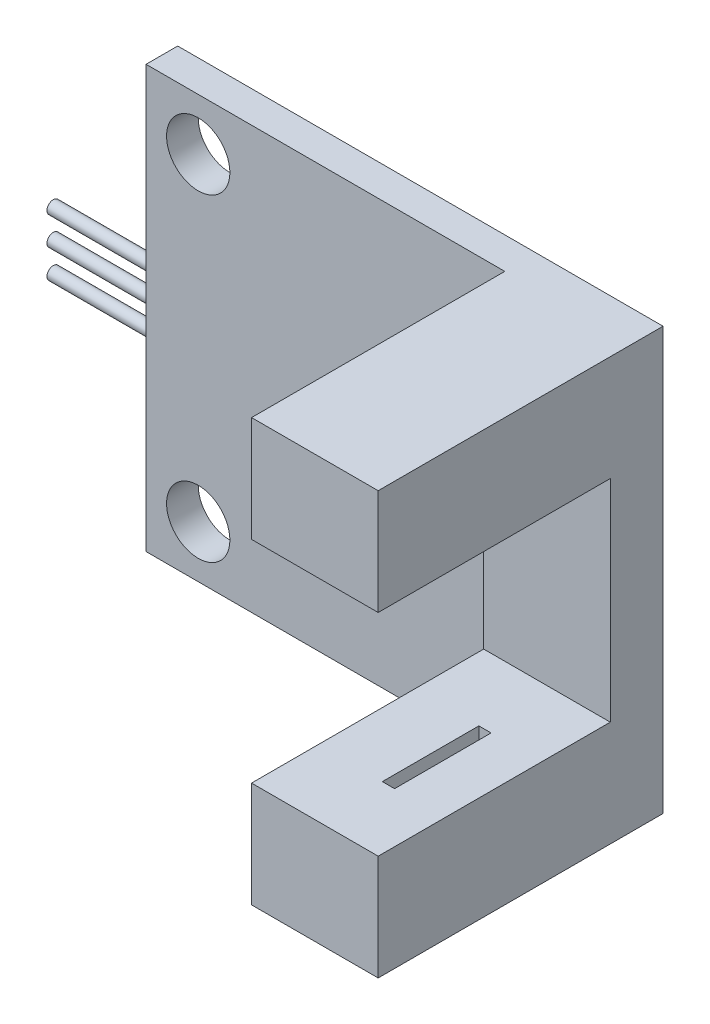
ISO-10303-21;
HEADER;
FILE_DESCRIPTION(('STEP AP214'),'2;1');
FILE_NAME('part.step','',(''),(''),'','','');
FILE_SCHEMA(('AUTOMOTIVE_DESIGN { 1 0 10303 214 1 1 1 1 }'));
ENDSEC;
DATA;
#1=APPLICATION_CONTEXT('core data for automotive mechanical design processes');
#2=APPLICATION_PROTOCOL_DEFINITION('international standard','automotive_design',2000,#1);
#3=PRODUCT_CONTEXT('',#1,'mechanical');
#4=PRODUCT('Part','Part','',(#3));
#5=PRODUCT_RELATED_PRODUCT_CATEGORY('part','',(#4));
#6=PRODUCT_DEFINITION_FORMATION('','',#4);
#7=PRODUCT_DEFINITION_CONTEXT('part definition',#1,'design');
#8=PRODUCT_DEFINITION('design','',#6,#7);
#9=PRODUCT_DEFINITION_SHAPE('','',#8);
#10=(LENGTH_UNIT() NAMED_UNIT(*) SI_UNIT(.MILLI.,.METRE.));
#11=(NAMED_UNIT(*) PLANE_ANGLE_UNIT() SI_UNIT($,.RADIAN.));
#12=(NAMED_UNIT(*) SI_UNIT($,.STERADIAN.) SOLID_ANGLE_UNIT());
#13=UNCERTAINTY_MEASURE_WITH_UNIT(LENGTH_MEASURE(1.E-05),#10,'distance_accuracy_value','');
#14=(GEOMETRIC_REPRESENTATION_CONTEXT(3) GLOBAL_UNCERTAINTY_ASSIGNED_CONTEXT((#13)) GLOBAL_UNIT_ASSIGNED_CONTEXT((#10,
#11,#12)) REPRESENTATION_CONTEXT('',''));
#15=CARTESIAN_POINT('',(0.,0.,0.));
#16=DIRECTION('',(0.,0.,1.));
#17=DIRECTION('',(1.,0.,0.));
#18=AXIS2_PLACEMENT_3D('',#15,#16,#17);
#19=CARTESIAN_POINT('',(5.49999999999999,5.,2.5));
#20=DIRECTION('',(0.,1.,0.));
#21=DIRECTION('',(0.,0.,1.));
#22=AXIS2_PLACEMENT_3D('',#19,#20,#21);
#23=PLANE('',#22);
#24=DIRECTION('',(-1.,0.,0.));
#25=VECTOR('',#24,1.);
#26=CARTESIAN_POINT('',(5.49999999999999,5.,13.5));
#27=LINE('',#26,#25);
#28=CARTESIAN_POINT('',(11.5,5.,13.5));
#29=VERTEX_POINT('',#28);
#30=CARTESIAN_POINT('',(5.49999999999999,5.,13.5));
#31=VERTEX_POINT('',#30);
#32=EDGE_CURVE('E246',#29,#31,#27,.T.);
#33=ORIENTED_EDGE('',*,*,#32,.T.);
#34=DIRECTION('',(0.,0.,1.));
#35=VECTOR('',#34,1.);
#36=CARTESIAN_POINT('',(5.49999999999999,5.,2.5));
#37=LINE('',#36,#35);
#38=CARTESIAN_POINT('',(5.49999999999999,5.,2.5));
#39=VERTEX_POINT('',#38);
#40=EDGE_CURVE('E268',#39,#31,#37,.T.);
#41=ORIENTED_EDGE('',*,*,#40,.F.);
#42=DIRECTION('',(-1.,0.,0.));
#43=VECTOR('',#42,1.);
#44=CARTESIAN_POINT('',(5.49999999999999,5.,2.5));
#45=LINE('',#44,#43);
#46=CARTESIAN_POINT('',(11.5,5.,2.5));
#47=VERTEX_POINT('',#46);
#48=EDGE_CURVE('E250',#47,#39,#45,.T.);
#49=ORIENTED_EDGE('',*,*,#48,.F.);
#50=DIRECTION('',(0.,0.,1.));
#51=VECTOR('',#50,1.);
#52=CARTESIAN_POINT('',(11.5,5.,2.5));
#53=LINE('',#52,#51);
#54=EDGE_CURVE('E259',#47,#29,#53,.T.);
#55=ORIENTED_EDGE('',*,*,#54,.T.);
#56=EDGE_LOOP('',(#33,#41,#49,#55));
#57=FACE_BOUND('',#56,.T.);
#58=DIRECTION('',(0.,0.,-1.));
#59=VECTOR('',#58,1.);
#60=CARTESIAN_POINT('',(9.11861969780148,5.,10.3413010577356));
#61=LINE('',#60,#59);
#62=CARTESIAN_POINT('',(9.11861969780148,5.,10.3413010577356));
#63=VERTEX_POINT('',#62);
#64=CARTESIAN_POINT('',(9.11861969780148,5.,5.76814798313308));
#65=VERTEX_POINT('',#64);
#66=EDGE_CURVE('E52',#63,#65,#61,.T.);
#67=ORIENTED_EDGE('',*,*,#66,.T.);
#68=DIRECTION('',(-1.,0.,0.));
#69=VECTOR('',#68,1.);
#70=CARTESIAN_POINT('',(8.53895916350211,5.,5.76814798313308));
#71=LINE('',#70,#69);
#72=CARTESIAN_POINT('',(8.53895916350211,5.,5.76814798313308));
#73=VERTEX_POINT('',#72);
#74=EDGE_CURVE('E182',#65,#73,#71,.T.);
#75=ORIENTED_EDGE('',*,*,#74,.T.);
#76=DIRECTION('',(0.,0.,1.));
#77=VECTOR('',#76,1.);
#78=CARTESIAN_POINT('',(8.53895916350211,5.,10.3413010577356));
#79=LINE('',#78,#77);
#80=CARTESIAN_POINT('',(8.53895916350211,5.,10.3413010577356));
#81=VERTEX_POINT('',#80);
#82=EDGE_CURVE('E185',#73,#81,#79,.T.);
#83=ORIENTED_EDGE('',*,*,#82,.T.);
#84=DIRECTION('',(1.,0.,0.));
#85=VECTOR('',#84,1.);
#86=CARTESIAN_POINT('',(8.53895916350211,5.,10.3413010577356));
#87=LINE('',#86,#85);
#88=EDGE_CURVE('E191',#81,#63,#87,.T.);
#89=ORIENTED_EDGE('',*,*,#88,.T.);
#90=EDGE_LOOP('',(#67,#75,#83,#89));
#91=FACE_BOUND('',#90,.T.);
#92=ADVANCED_FACE('F35',(#57,#91),#23,.F.);
#93=CARTESIAN_POINT('',(0.,0.,13.5));
#94=DIRECTION('',(0.,0.,1.));
#95=DIRECTION('',(1.,0.,0.));
#96=AXIS2_PLACEMENT_3D('',#93,#94,#95);
#97=PLANE('',#96);
#98=DIRECTION('',(1.,0.,0.));
#99=VECTOR('',#98,1.);
#100=CARTESIAN_POINT('',(5.49999999999999,-5.,13.5));
#101=LINE('',#100,#99);
#102=CARTESIAN_POINT('',(5.49999999999999,-5.,13.5));
#103=VERTEX_POINT('',#102);
#104=CARTESIAN_POINT('',(11.5,-5.,13.5));
#105=VERTEX_POINT('',#104);
#106=EDGE_CURVE('E251',#103,#105,#101,.T.);
#107=ORIENTED_EDGE('',*,*,#106,.F.);
#108=DIRECTION('',(0.,-1.,0.));
#109=VECTOR('',#108,1.);
#110=CARTESIAN_POINT('',(5.49999999999999,10.,13.5));
#111=LINE('',#110,#109);
#112=CARTESIAN_POINT('',(5.49999999999999,-10.,13.5));
#113=VERTEX_POINT('',#112);
#114=EDGE_CURVE('E278',#103,#113,#111,.T.);
#115=ORIENTED_EDGE('',*,*,#114,.T.);
#116=DIRECTION('',(1.,0.,0.));
#117=VECTOR('',#116,1.);
#118=CARTESIAN_POINT('',(5.49999999999999,-10.,13.5));
#119=LINE('',#118,#117);
#120=CARTESIAN_POINT('',(11.5,-10.,13.5));
#121=VERTEX_POINT('',#120);
#122=EDGE_CURVE('E282',#113,#121,#119,.T.);
#123=ORIENTED_EDGE('',*,*,#122,.T.);
#124=DIRECTION('',(0.,1.,0.));
#125=VECTOR('',#124,1.);
#126=CARTESIAN_POINT('',(11.5,-10.,13.5));
#127=LINE('',#126,#125);
#128=EDGE_CURVE('E272',#121,#105,#127,.T.);
#129=ORIENTED_EDGE('',*,*,#128,.T.);
#130=EDGE_LOOP('',(#107,#115,#123,#129));
#131=FACE_BOUND('',#130,.T.);
#132=ADVANCED_FACE('F350',(#131),#97,.T.);
#133=CARTESIAN_POINT('',(0.,0.,1.5));
#134=DIRECTION('',(0.,0.,-1.));
#135=DIRECTION('',(-1.,0.,0.));
#136=AXIS2_PLACEMENT_3D('',#133,#134,#135);
#137=PLANE('',#136);
#138=CARTESIAN_POINT('',(-9.02815066894469,7.54064677849442,1.5));
#139=DIRECTION('',(0.,0.,-1.));
#140=DIRECTION('',(1.,0.,0.));
#141=AXIS2_PLACEMENT_3D('',#138,#139,#140);
#142=CIRCLE('',#141,1.5);
#143=CARTESIAN_POINT('',(-7.52815066894469,7.54064677849442,1.5));
#144=VERTEX_POINT('',#143);
#145=EDGE_CURVE('E225',#144,#144,#142,.T.);
#146=ORIENTED_EDGE('',*,*,#145,.T.);
#147=EDGE_LOOP('',(#146));
#148=FACE_BOUND('',#147,.T.);
#149=CARTESIAN_POINT('',(-9.02815066894469,-7.54064677849442,1.5));
#150=DIRECTION('',(0.,0.,1.));
#151=DIRECTION('',(1.,0.,0.));
#152=AXIS2_PLACEMENT_3D('',#149,#150,#151);
#153=CIRCLE('',#152,1.5);
#154=CARTESIAN_POINT('',(-7.52815066894469,-7.54064677849442,1.5));
#155=VERTEX_POINT('',#154);
#156=EDGE_CURVE('E233',#155,#155,#153,.T.);
#157=ORIENTED_EDGE('',*,*,#156,.F.);
#158=EDGE_LOOP('',(#157));
#159=FACE_BOUND('',#158,.T.);
#160=DIRECTION('',(0.,-1.,0.));
#161=VECTOR('',#160,1.);
#162=CARTESIAN_POINT('',(5.49999999999999,10.,1.5));
#163=LINE('',#162,#161);
#164=CARTESIAN_POINT('',(5.49999999999999,10.,1.5));
#165=VERTEX_POINT('',#164);
#166=CARTESIAN_POINT('',(5.49999999999999,-10.,1.5));
#167=VERTEX_POINT('',#166);
#168=EDGE_CURVE('E265',#165,#167,#163,.T.);
#169=ORIENTED_EDGE('',*,*,#168,.F.);
#170=DIRECTION('',(-1.,0.,0.));
#171=VECTOR('',#170,1.);
#172=CARTESIAN_POINT('',(-11.5,10.,1.5));
#173=LINE('',#172,#171);
#174=CARTESIAN_POINT('',(-11.5,10.,1.5));
#175=VERTEX_POINT('',#174);
#176=EDGE_CURVE('E294',#165,#175,#173,.T.);
#177=ORIENTED_EDGE('',*,*,#176,.T.);
#178=DIRECTION('',(0.,-1.,0.));
#179=VECTOR('',#178,1.);
#180=CARTESIAN_POINT('',(-11.5,-10.,1.5));
#181=LINE('',#180,#179);
#182=CARTESIAN_POINT('',(-11.5,-10.,1.5));
#183=VERTEX_POINT('',#182);
#184=EDGE_CURVE('E296',#175,#183,#181,.T.);
#185=ORIENTED_EDGE('',*,*,#184,.T.);
#186=DIRECTION('',(1.,0.,0.));
#187=VECTOR('',#186,1.);
#188=CARTESIAN_POINT('',(-11.5,-10.,1.5));
#189=LINE('',#188,#187);
#190=EDGE_CURVE('E299',#183,#167,#189,.T.);
#191=ORIENTED_EDGE('',*,*,#190,.T.);
#192=EDGE_LOOP('',(#169,#177,#185,#191));
#193=FACE_BOUND('',#192,.T.);
#194=ADVANCED_FACE('F358',(#148,#159,#193),#137,.F.);
#195=CARTESIAN_POINT('',(11.5,-10.,1.5));
#196=DIRECTION('',(-1.,0.,0.));
#197=DIRECTION('',(0.,0.,1.));
#198=AXIS2_PLACEMENT_3D('',#195,#196,#197);
#199=PLANE('',#198);
#200=DIRECTION('',(0.,1.,0.));
#201=VECTOR('',#200,1.);
#202=CARTESIAN_POINT('',(11.5,-5.,2.5));
#203=LINE('',#202,#201);
#204=CARTESIAN_POINT('',(11.5,-5.,2.5));
#205=VERTEX_POINT('',#204);
#206=EDGE_CURVE('E247',#205,#47,#203,.T.);
#207=ORIENTED_EDGE('',*,*,#206,.F.);
#208=DIRECTION('',(0.,0.,1.));
#209=VECTOR('',#208,1.);
#210=CARTESIAN_POINT('',(11.5,-5.,2.5));
#211=LINE('',#210,#209);
#212=EDGE_CURVE('E262',#205,#105,#211,.T.);
#213=ORIENTED_EDGE('',*,*,#212,.T.);
#214=ORIENTED_EDGE('',*,*,#128,.F.);
#215=DIRECTION('',(0.,0.,-1.));
#216=VECTOR('',#215,1.);
#217=CARTESIAN_POINT('',(11.5,-10.,1.5));
#218=LINE('',#217,#216);
#219=CARTESIAN_POINT('',(11.5,-10.,0.));
#220=VERTEX_POINT('',#219);
#221=EDGE_CURVE('E301',#121,#220,#218,.T.);
#222=ORIENTED_EDGE('',*,*,#221,.T.);
#223=DIRECTION('',(0.,1.,0.));
#224=VECTOR('',#223,1.);
#225=CARTESIAN_POINT('',(11.5,-10.,0.));
#226=LINE('',#225,#224);
#227=CARTESIAN_POINT('',(11.5,10.,0.));
#228=VERTEX_POINT('',#227);
#229=EDGE_CURVE('E293',#220,#228,#226,.T.);
#230=ORIENTED_EDGE('',*,*,#229,.T.);
#231=DIRECTION('',(0.,0.,-1.));
#232=VECTOR('',#231,1.);
#233=CARTESIAN_POINT('',(11.5,10.,1.5));
#234=LINE('',#233,#232);
#235=CARTESIAN_POINT('',(11.5,10.,13.5));
#236=VERTEX_POINT('',#235);
#237=EDGE_CURVE('E317',#236,#228,#234,.T.);
#238=ORIENTED_EDGE('',*,*,#237,.F.);
#239=EDGE_CURVE('E276',#29,#236,#127,.T.);
#240=ORIENTED_EDGE('',*,*,#239,.F.);
#241=ORIENTED_EDGE('',*,*,#54,.F.);
#242=EDGE_LOOP('',(#207,#213,#214,#222,#230,#238,#240,#241));
#243=FACE_BOUND('',#242,.T.);
#244=ADVANCED_FACE('F37',(#243),#199,.F.);
#245=CARTESIAN_POINT('',(-11.5,10.,1.5));
#246=DIRECTION('',(0.,-1.,0.));
#247=DIRECTION('',(0.,0.,-1.));
#248=AXIS2_PLACEMENT_3D('',#245,#246,#247);
#249=PLANE('',#248);
#250=DIRECTION('',(-1.,0.,0.));
#251=VECTOR('',#250,1.);
#252=CARTESIAN_POINT('',(-11.5,10.,0.));
#253=LINE('',#252,#251);
#254=CARTESIAN_POINT('',(-11.5,10.,0.));
#255=VERTEX_POINT('',#254);
#256=EDGE_CURVE('E304',#228,#255,#253,.T.);
#257=ORIENTED_EDGE('',*,*,#256,.T.);
#258=DIRECTION('',(0.,0.,-1.));
#259=VECTOR('',#258,1.);
#260=CARTESIAN_POINT('',(-11.5,10.,1.5));
#261=LINE('',#260,#259);
#262=EDGE_CURVE('E314',#175,#255,#261,.T.);
#263=ORIENTED_EDGE('',*,*,#262,.F.);
#264=ORIENTED_EDGE('',*,*,#176,.F.);
#265=DIRECTION('',(0.,0.,-1.));
#266=VECTOR('',#265,1.);
#267=CARTESIAN_POINT('',(5.49999999999999,10.,13.5));
#268=LINE('',#267,#266);
#269=CARTESIAN_POINT('',(5.49999999999999,10.,13.5));
#270=VERTEX_POINT('',#269);
#271=EDGE_CURVE('E290',#270,#165,#268,.T.);
#272=ORIENTED_EDGE('',*,*,#271,.F.);
#273=DIRECTION('',(-1.,0.,0.));
#274=VECTOR('',#273,1.);
#275=CARTESIAN_POINT('',(11.5,10.,13.5));
#276=LINE('',#275,#274);
#277=EDGE_CURVE('E275',#236,#270,#276,.T.);
#278=ORIENTED_EDGE('',*,*,#277,.F.);
#279=ORIENTED_EDGE('',*,*,#237,.T.);
#280=EDGE_LOOP('',(#257,#263,#264,#272,#278,#279));
#281=FACE_BOUND('',#280,.T.);
#282=ADVANCED_FACE('F365',(#281),#249,.F.);
#283=CARTESIAN_POINT('',(-11.5,-10.,1.5));
#284=DIRECTION('',(1.,0.,0.));
#285=DIRECTION('',(0.,0.,-1.));
#286=AXIS2_PLACEMENT_3D('',#283,#284,#285);
#287=PLANE('',#286);
#288=CARTESIAN_POINT('',(-11.5,-1.36124493315748,0.896688641219612));
#289=DIRECTION('',(1.,0.,0.));
#290=DIRECTION('',(0.,0.,-1.));
#291=AXIS2_PLACEMENT_3D('',#288,#289,#290);
#292=CIRCLE('',#291,0.3);
#293=CARTESIAN_POINT('',(-11.5,-1.36124493315748,0.596688641219612));
#294=VERTEX_POINT('',#293);
#295=EDGE_CURVE('E11',#294,#294,#292,.F.);
#296=ORIENTED_EDGE('',*,*,#295,.F.);
#297=EDGE_LOOP('',(#296));
#298=FACE_BOUND('',#297,.T.);
#299=CARTESIAN_POINT('',(-11.5,0.,0.896688641219612));
#300=DIRECTION('',(1.,0.,0.));
#301=DIRECTION('',(0.,0.,-1.));
#302=AXIS2_PLACEMENT_3D('',#299,#300,#301);
#303=CIRCLE('',#302,0.3);
#304=CARTESIAN_POINT('',(-11.5,0.,0.596688641219612));
#305=VERTEX_POINT('',#304);
#306=EDGE_CURVE('E44',#305,#305,#303,.F.);
#307=ORIENTED_EDGE('',*,*,#306,.F.);
#308=EDGE_LOOP('',(#307));
#309=FACE_BOUND('',#308,.T.);
#310=CARTESIAN_POINT('',(-11.5,1.34349160318692,0.896688641219612));
#311=DIRECTION('',(1.,0.,0.));
#312=DIRECTION('',(0.,0.,-1.));
#313=AXIS2_PLACEMENT_3D('',#310,#311,#312);
#314=CIRCLE('',#313,0.3);
#315=CARTESIAN_POINT('',(-11.5,1.34349160318692,0.596688641219612));
#316=VERTEX_POINT('',#315);
#317=EDGE_CURVE('E320',#316,#316,#314,.F.);
#318=ORIENTED_EDGE('',*,*,#317,.F.);
#319=EDGE_LOOP('',(#318));
#320=FACE_BOUND('',#319,.T.);
#321=DIRECTION('',(0.,-1.,0.));
#322=VECTOR('',#321,1.);
#323=CARTESIAN_POINT('',(-11.5,-10.,0.));
#324=LINE('',#323,#322);
#325=CARTESIAN_POINT('',(-11.5,-10.,0.));
#326=VERTEX_POINT('',#325);
#327=EDGE_CURVE('E306',#255,#326,#324,.T.);
#328=ORIENTED_EDGE('',*,*,#327,.T.);
#329=DIRECTION('',(0.,0.,-1.));
#330=VECTOR('',#329,1.);
#331=CARTESIAN_POINT('',(-11.5,-10.,1.5));
#332=LINE('',#331,#330);
#333=EDGE_CURVE('E311',#183,#326,#332,.T.);
#334=ORIENTED_EDGE('',*,*,#333,.F.);
#335=ORIENTED_EDGE('',*,*,#184,.F.);
#336=ORIENTED_EDGE('',*,*,#262,.T.);
#337=EDGE_LOOP('',(#328,#334,#335,#336));
#338=FACE_BOUND('',#337,.T.);
#339=ADVANCED_FACE('F363',(#298,#309,#320,#338),#287,.F.);
#340=CARTESIAN_POINT('',(-11.5,-10.,1.5));
#341=DIRECTION('',(0.,1.,0.));
#342=DIRECTION('',(0.,0.,1.));
#343=AXIS2_PLACEMENT_3D('',#340,#341,#342);
#344=PLANE('',#343);
#345=DIRECTION('',(1.,0.,0.));
#346=VECTOR('',#345,1.);
#347=CARTESIAN_POINT('',(-11.5,-10.,0.));
#348=LINE('',#347,#346);
#349=EDGE_CURVE('E297',#326,#220,#348,.T.);
#350=ORIENTED_EDGE('',*,*,#349,.T.);
#351=ORIENTED_EDGE('',*,*,#221,.F.);
#352=ORIENTED_EDGE('',*,*,#122,.F.);
#353=DIRECTION('',(0.,0.,-1.));
#354=VECTOR('',#353,1.);
#355=CARTESIAN_POINT('',(5.49999999999999,-10.,13.5));
#356=LINE('',#355,#354);
#357=EDGE_CURVE('E285',#113,#167,#356,.T.);
#358=ORIENTED_EDGE('',*,*,#357,.T.);
#359=ORIENTED_EDGE('',*,*,#190,.F.);
#360=ORIENTED_EDGE('',*,*,#333,.T.);
#361=EDGE_LOOP('',(#350,#351,#352,#358,#359,#360));
#362=FACE_BOUND('',#361,.T.);
#363=ADVANCED_FACE('F334',(#362),#344,.F.);
#364=CARTESIAN_POINT('',(0.,0.,0.));
#365=DIRECTION('',(0.,0.,-1.));
#366=DIRECTION('',(-1.,0.,0.));
#367=AXIS2_PLACEMENT_3D('',#364,#365,#366);
#368=PLANE('',#367);
#369=CARTESIAN_POINT('',(-9.02815066894469,7.54064677849442,0.));
#370=DIRECTION('',(0.,0.,-1.));
#371=DIRECTION('',(-1.,0.,0.));
#372=AXIS2_PLACEMENT_3D('',#369,#370,#371);
#373=CIRCLE('',#372,1.5);
#374=CARTESIAN_POINT('',(-10.5281506689447,7.54064677849442,0.));
#375=VERTEX_POINT('',#374);
#376=EDGE_CURVE('E39',#375,#375,#373,.F.);
#377=ORIENTED_EDGE('',*,*,#376,.T.);
#378=EDGE_LOOP('',(#377));
#379=FACE_BOUND('',#378,.T.);
#380=CARTESIAN_POINT('',(-9.02815066894469,-7.54064677849442,0.));
#381=DIRECTION('',(0.,0.,-1.));
#382=DIRECTION('',(-1.,0.,0.));
#383=AXIS2_PLACEMENT_3D('',#380,#381,#382);
#384=CIRCLE('',#383,1.5);
#385=CARTESIAN_POINT('',(-10.5281506689447,-7.54064677849442,0.));
#386=VERTEX_POINT('',#385);
#387=EDGE_CURVE('E236',#386,#386,#384,.T.);
#388=ORIENTED_EDGE('',*,*,#387,.F.);
#389=EDGE_LOOP('',(#388));
#390=FACE_BOUND('',#389,.T.);
#391=ORIENTED_EDGE('',*,*,#229,.F.);
#392=ORIENTED_EDGE('',*,*,#349,.F.);
#393=ORIENTED_EDGE('',*,*,#327,.F.);
#394=ORIENTED_EDGE('',*,*,#256,.F.);
#395=EDGE_LOOP('',(#391,#392,#393,#394));
#396=FACE_BOUND('',#395,.T.);
#397=ADVANCED_FACE('F330',(#379,#390,#396),#368,.T.);
#398=CARTESIAN_POINT('',(5.49999999999999,10.,13.5));
#399=DIRECTION('',(1.,0.,0.));
#400=DIRECTION('',(0.,1.,0.));
#401=AXIS2_PLACEMENT_3D('',#398,#399,#400);
#402=PLANE('',#401);
#403=ORIENTED_EDGE('',*,*,#114,.F.);
#404=DIRECTION('',(0.,0.,1.));
#405=VECTOR('',#404,1.);
#406=CARTESIAN_POINT('',(5.49999999999999,-5.,2.5));
#407=LINE('',#406,#405);
#408=CARTESIAN_POINT('',(5.49999999999999,-5.,2.5));
#409=VERTEX_POINT('',#408);
#410=EDGE_CURVE('E266',#409,#103,#407,.T.);
#411=ORIENTED_EDGE('',*,*,#410,.F.);
#412=DIRECTION('',(0.,-1.,0.));
#413=VECTOR('',#412,1.);
#414=CARTESIAN_POINT('',(5.49999999999999,-5.,2.5));
#415=LINE('',#414,#413);
#416=EDGE_CURVE('E254',#39,#409,#415,.T.);
#417=ORIENTED_EDGE('',*,*,#416,.F.);
#418=ORIENTED_EDGE('',*,*,#40,.T.);
#419=EDGE_CURVE('E279',#270,#31,#111,.T.);
#420=ORIENTED_EDGE('',*,*,#419,.F.);
#421=ORIENTED_EDGE('',*,*,#271,.T.);
#422=ORIENTED_EDGE('',*,*,#168,.T.);
#423=ORIENTED_EDGE('',*,*,#357,.F.);
#424=EDGE_LOOP('',(#403,#411,#417,#418,#420,#421,#422,#423));
#425=FACE_BOUND('',#424,.T.);
#426=ADVANCED_FACE('F333',(#425),#402,.F.);
#427=ORIENTED_EDGE('',*,*,#32,.F.);
#428=ORIENTED_EDGE('',*,*,#239,.T.);
#429=ORIENTED_EDGE('',*,*,#277,.T.);
#430=ORIENTED_EDGE('',*,*,#419,.T.);
#431=EDGE_LOOP('',(#427,#428,#429,#430));
#432=FACE_BOUND('',#431,.T.);
#433=ADVANCED_FACE('F370',(#432),#97,.T.);
#434=CARTESIAN_POINT('',(5.49999999999999,-5.,2.5));
#435=DIRECTION('',(0.,-1.,0.));
#436=DIRECTION('',(0.,0.,-1.));
#437=AXIS2_PLACEMENT_3D('',#434,#435,#436);
#438=PLANE('',#437);
#439=DIRECTION('',(-1.,0.,0.));
#440=VECTOR('',#439,1.);
#441=CARTESIAN_POINT('',(8.53895916350211,-5.,5.76814798313308));
#442=LINE('',#441,#440);
#443=CARTESIAN_POINT('',(9.11861969780148,-5.,5.76814798313308));
#444=VERTEX_POINT('',#443);
#445=CARTESIAN_POINT('',(8.53895916350211,-5.,5.76814798313308));
#446=VERTEX_POINT('',#445);
#447=EDGE_CURVE('E215',#444,#446,#442,.T.);
#448=ORIENTED_EDGE('',*,*,#447,.F.);
#449=DIRECTION('',(0.,0.,-1.));
#450=VECTOR('',#449,1.);
#451=CARTESIAN_POINT('',(9.11861969780148,-5.,10.3413010577356));
#452=LINE('',#451,#450);
#453=CARTESIAN_POINT('',(9.11861969780148,-5.,10.3413010577356));
#454=VERTEX_POINT('',#453);
#455=EDGE_CURVE('E60',#454,#444,#452,.T.);
#456=ORIENTED_EDGE('',*,*,#455,.F.);
#457=DIRECTION('',(1.,0.,0.));
#458=VECTOR('',#457,1.);
#459=CARTESIAN_POINT('',(8.53895916350211,-5.,10.3413010577356));
#460=LINE('',#459,#458);
#461=CARTESIAN_POINT('',(8.53895916350211,-5.,10.3413010577356));
#462=VERTEX_POINT('',#461);
#463=EDGE_CURVE('E204',#462,#454,#460,.T.);
#464=ORIENTED_EDGE('',*,*,#463,.F.);
#465=DIRECTION('',(0.,0.,1.));
#466=VECTOR('',#465,1.);
#467=CARTESIAN_POINT('',(8.53895916350211,-5.,10.3413010577356));
#468=LINE('',#467,#466);
#469=EDGE_CURVE('E218',#446,#462,#468,.T.);
#470=ORIENTED_EDGE('',*,*,#469,.F.);
#471=EDGE_LOOP('',(#448,#456,#464,#470));
#472=FACE_BOUND('',#471,.T.);
#473=ORIENTED_EDGE('',*,*,#106,.T.);
#474=ORIENTED_EDGE('',*,*,#212,.F.);
#475=DIRECTION('',(1.,0.,0.));
#476=VECTOR('',#475,1.);
#477=CARTESIAN_POINT('',(5.49999999999999,-5.,2.5));
#478=LINE('',#477,#476);
#479=EDGE_CURVE('E256',#409,#205,#478,.T.);
#480=ORIENTED_EDGE('',*,*,#479,.F.);
#481=ORIENTED_EDGE('',*,*,#410,.T.);
#482=EDGE_LOOP('',(#473,#474,#480,#481));
#483=FACE_BOUND('',#482,.T.);
#484=ADVANCED_FACE('F379',(#472,#483),#438,.F.);
#485=CARTESIAN_POINT('',(0.,0.,2.5));
#486=DIRECTION('',(0.,0.,-1.));
#487=DIRECTION('',(-1.,0.,0.));
#488=AXIS2_PLACEMENT_3D('',#485,#486,#487);
#489=PLANE('',#488);
#490=ORIENTED_EDGE('',*,*,#206,.T.);
#491=ORIENTED_EDGE('',*,*,#48,.T.);
#492=ORIENTED_EDGE('',*,*,#416,.T.);
#493=ORIENTED_EDGE('',*,*,#479,.T.);
#494=EDGE_LOOP('',(#490,#491,#492,#493));
#495=FACE_BOUND('',#494,.T.);
#496=ADVANCED_FACE('F376',(#495),#489,.F.);
#497=CARTESIAN_POINT('',(-16.5,1.34349160318692,0.896688641219612));
#498=DIRECTION('',(1.,0.,0.));
#499=DIRECTION('',(0.,0.,-1.));
#500=AXIS2_PLACEMENT_3D('',#497,#498,#499);
#501=CYLINDRICAL_SURFACE('',#500,0.3);
#502=CARTESIAN_POINT('',(-16.5,1.34349160318692,0.896688641219612));
#503=DIRECTION('',(-1.,0.,0.));
#504=DIRECTION('',(0.,0.,1.));
#505=AXIS2_PLACEMENT_3D('',#502,#503,#504);
#506=CIRCLE('',#505,0.3);
#507=CARTESIAN_POINT('',(-16.5,1.34349160318692,1.19668864121961));
#508=VERTEX_POINT('',#507);
#509=EDGE_CURVE('E243',#508,#508,#506,.T.);
#510=ORIENTED_EDGE('',*,*,#509,.F.);
#511=EDGE_LOOP('',(#510));
#512=FACE_BOUND('',#511,.T.);
#513=ORIENTED_EDGE('',*,*,#317,.T.);
#514=EDGE_LOOP('',(#513));
#515=FACE_BOUND('',#514,.T.);
#516=ADVANCED_FACE('F387',(#512,#515),#501,.T.);
#517=CARTESIAN_POINT('',(-16.5,1.34349160318692,0.896688641219612));
#518=DIRECTION('',(-1.,0.,0.));
#519=DIRECTION('',(0.,0.,1.));
#520=AXIS2_PLACEMENT_3D('',#517,#518,#519);
#521=PLANE('',#520);
#522=ORIENTED_EDGE('',*,*,#509,.T.);
#523=EDGE_LOOP('',(#522));
#524=FACE_BOUND('',#523,.T.);
#525=ADVANCED_FACE('F473',(#524),#521,.T.);
#526=CARTESIAN_POINT('',(-16.5,0.,0.896688641219612));
#527=DIRECTION('',(1.,0.,0.));
#528=DIRECTION('',(0.,0.,-1.));
#529=AXIS2_PLACEMENT_3D('',#526,#527,#528);
#530=CYLINDRICAL_SURFACE('',#529,0.3);
#531=CARTESIAN_POINT('',(-16.5,0.,0.896688641219612));
#532=DIRECTION('',(-1.,0.,0.));
#533=DIRECTION('',(0.,0.,1.));
#534=AXIS2_PLACEMENT_3D('',#531,#532,#533);
#535=CIRCLE('',#534,0.3);
#536=CARTESIAN_POINT('',(-16.5,0.,1.19668864121961));
#537=VERTEX_POINT('',#536);
#538=EDGE_CURVE('E240',#537,#537,#535,.T.);
#539=ORIENTED_EDGE('',*,*,#538,.F.);
#540=EDGE_LOOP('',(#539));
#541=FACE_BOUND('',#540,.T.);
#542=ORIENTED_EDGE('',*,*,#306,.T.);
#543=EDGE_LOOP('',(#542));
#544=FACE_BOUND('',#543,.T.);
#545=ADVANCED_FACE('F483',(#541,#544),#530,.T.);
#546=CARTESIAN_POINT('',(-16.5,0.,0.896688641219612));
#547=DIRECTION('',(-1.,0.,0.));
#548=DIRECTION('',(0.,0.,1.));
#549=AXIS2_PLACEMENT_3D('',#546,#547,#548);
#550=PLANE('',#549);
#551=ORIENTED_EDGE('',*,*,#538,.T.);
#552=EDGE_LOOP('',(#551));
#553=FACE_BOUND('',#552,.T.);
#554=ADVANCED_FACE('F493',(#553),#550,.T.);
#555=CARTESIAN_POINT('',(-16.5,-1.36124493315748,0.896688641219612));
#556=DIRECTION('',(1.,0.,0.));
#557=DIRECTION('',(0.,0.,-1.));
#558=AXIS2_PLACEMENT_3D('',#555,#556,#557);
#559=CYLINDRICAL_SURFACE('',#558,0.3);
#560=CARTESIAN_POINT('',(-16.5,-1.36124493315748,0.896688641219612));
#561=DIRECTION('',(-1.,0.,0.));
#562=DIRECTION('',(0.,0.,1.));
#563=AXIS2_PLACEMENT_3D('',#560,#561,#562);
#564=CIRCLE('',#563,0.3);
#565=CARTESIAN_POINT('',(-16.5,-1.36124493315748,1.19668864121961));
#566=VERTEX_POINT('',#565);
#567=EDGE_CURVE('E237',#566,#566,#564,.T.);
#568=ORIENTED_EDGE('',*,*,#567,.F.);
#569=EDGE_LOOP('',(#568));
#570=FACE_BOUND('',#569,.T.);
#571=ORIENTED_EDGE('',*,*,#295,.T.);
#572=EDGE_LOOP('',(#571));
#573=FACE_BOUND('',#572,.T.);
#574=ADVANCED_FACE('F503',(#570,#573),#559,.T.);
#575=CARTESIAN_POINT('',(-16.5,-1.36124493315748,0.896688641219612));
#576=DIRECTION('',(-1.,0.,0.));
#577=DIRECTION('',(0.,0.,1.));
#578=AXIS2_PLACEMENT_3D('',#575,#576,#577);
#579=PLANE('',#578);
#580=ORIENTED_EDGE('',*,*,#567,.T.);
#581=EDGE_LOOP('',(#580));
#582=FACE_BOUND('',#581,.T.);
#583=ADVANCED_FACE('F513',(#582),#579,.T.);
#584=CARTESIAN_POINT('',(-9.02815066894469,-7.54064677849442,-5.5));
#585=DIRECTION('',(0.,0.,1.));
#586=DIRECTION('',(1.,0.,0.));
#587=AXIS2_PLACEMENT_3D('',#584,#585,#586);
#588=CYLINDRICAL_SURFACE('',#587,1.5);
#589=ORIENTED_EDGE('',*,*,#387,.T.);
#590=EDGE_LOOP('',(#589));
#591=FACE_BOUND('',#590,.T.);
#592=ORIENTED_EDGE('',*,*,#156,.T.);
#593=EDGE_LOOP('',(#592));
#594=FACE_BOUND('',#593,.T.);
#595=ADVANCED_FACE('F327',(#591,#594),#588,.F.);
#596=CARTESIAN_POINT('',(-9.02815066894469,7.54064677849442,-5.5));
#597=DIRECTION('',(0.,0.,1.));
#598=DIRECTION('',(1.,0.,0.));
#599=AXIS2_PLACEMENT_3D('',#596,#597,#598);
#600=CYLINDRICAL_SURFACE('',#599,1.5);
#601=ORIENTED_EDGE('',*,*,#376,.F.);
#602=EDGE_LOOP('',(#601));
#603=FACE_BOUND('',#602,.T.);
#604=ORIENTED_EDGE('',*,*,#145,.F.);
#605=EDGE_LOOP('',(#604));
#606=FACE_BOUND('',#605,.T.);
#607=ADVANCED_FACE('F530',(#603,#606),#600,.F.);
#608=CARTESIAN_POINT('',(9.11861969780148,-7.,10.3413010577356));
#609=DIRECTION('',(1.,0.,0.));
#610=DIRECTION('',(0.,0.,-1.));
#611=AXIS2_PLACEMENT_3D('',#608,#609,#610);
#612=PLANE('',#611);
#613=ORIENTED_EDGE('',*,*,#455,.T.);
#614=DIRECTION('',(0.,1.,0.));
#615=VECTOR('',#614,1.);
#616=CARTESIAN_POINT('',(9.11861969780148,-7.,5.76814798313308));
#617=LINE('',#616,#615);
#618=CARTESIAN_POINT('',(9.11861969780148,-7.,5.76814798313308));
#619=VERTEX_POINT('',#618);
#620=EDGE_CURVE('E213',#619,#444,#617,.T.);
#621=ORIENTED_EDGE('',*,*,#620,.F.);
#622=DIRECTION('',(0.,0.,-1.));
#623=VECTOR('',#622,1.);
#624=CARTESIAN_POINT('',(9.11861969780148,-7.,10.3413010577356));
#625=LINE('',#624,#623);
#626=CARTESIAN_POINT('',(9.11861969780148,-7.,10.3413010577356));
#627=VERTEX_POINT('',#626);
#628=EDGE_CURVE('E200',#627,#619,#625,.T.);
#629=ORIENTED_EDGE('',*,*,#628,.F.);
#630=DIRECTION('',(0.,1.,0.));
#631=VECTOR('',#630,1.);
#632=CARTESIAN_POINT('',(9.11861969780148,-7.,10.3413010577356));
#633=LINE('',#632,#631);
#634=EDGE_CURVE('E223',#627,#454,#633,.T.);
#635=ORIENTED_EDGE('',*,*,#634,.T.);
#636=EDGE_LOOP('',(#613,#621,#629,#635));
#637=FACE_BOUND('',#636,.T.);
#638=ADVANCED_FACE('F539',(#637),#612,.F.);
#639=CARTESIAN_POINT('',(8.53895916350211,-7.,10.3413010577356));
#640=DIRECTION('',(0.,0.,1.));
#641=DIRECTION('',(1.,0.,0.));
#642=AXIS2_PLACEMENT_3D('',#639,#640,#641);
#643=PLANE('',#642);
#644=ORIENTED_EDGE('',*,*,#463,.T.);
#645=ORIENTED_EDGE('',*,*,#634,.F.);
#646=DIRECTION('',(1.,0.,0.));
#647=VECTOR('',#646,1.);
#648=CARTESIAN_POINT('',(8.53895916350211,-7.,10.3413010577356));
#649=LINE('',#648,#647);
#650=CARTESIAN_POINT('',(8.53895916350211,-7.,10.3413010577356));
#651=VERTEX_POINT('',#650);
#652=EDGE_CURVE('E210',#651,#627,#649,.T.);
#653=ORIENTED_EDGE('',*,*,#652,.F.);
#654=DIRECTION('',(0.,1.,0.));
#655=VECTOR('',#654,1.);
#656=CARTESIAN_POINT('',(8.53895916350211,-7.,10.3413010577356));
#657=LINE('',#656,#655);
#658=EDGE_CURVE('E226',#651,#462,#657,.T.);
#659=ORIENTED_EDGE('',*,*,#658,.T.);
#660=EDGE_LOOP('',(#644,#645,#653,#659));
#661=FACE_BOUND('',#660,.T.);
#662=ADVANCED_FACE('F546',(#661),#643,.F.);
#663=CARTESIAN_POINT('',(8.53895916350211,-7.,10.3413010577356));
#664=DIRECTION('',(-1.,0.,0.));
#665=DIRECTION('',(0.,0.,1.));
#666=AXIS2_PLACEMENT_3D('',#663,#664,#665);
#667=PLANE('',#666);
#668=ORIENTED_EDGE('',*,*,#469,.T.);
#669=ORIENTED_EDGE('',*,*,#658,.F.);
#670=DIRECTION('',(0.,0.,1.));
#671=VECTOR('',#670,1.);
#672=CARTESIAN_POINT('',(8.53895916350211,-7.,10.3413010577356));
#673=LINE('',#672,#671);
#674=CARTESIAN_POINT('',(8.53895916350211,-7.,5.76814798313308));
#675=VERTEX_POINT('',#674);
#676=EDGE_CURVE('E207',#675,#651,#673,.T.);
#677=ORIENTED_EDGE('',*,*,#676,.F.);
#678=DIRECTION('',(0.,1.,0.));
#679=VECTOR('',#678,1.);
#680=CARTESIAN_POINT('',(8.53895916350211,-7.,5.76814798313308));
#681=LINE('',#680,#679);
#682=EDGE_CURVE('E228',#675,#446,#681,.T.);
#683=ORIENTED_EDGE('',*,*,#682,.T.);
#684=EDGE_LOOP('',(#668,#669,#677,#683));
#685=FACE_BOUND('',#684,.T.);
#686=ADVANCED_FACE('F553',(#685),#667,.F.);
#687=CARTESIAN_POINT('',(8.53895916350211,-7.,5.76814798313308));
#688=DIRECTION('',(0.,0.,-1.));
#689=DIRECTION('',(-1.,0.,0.));
#690=AXIS2_PLACEMENT_3D('',#687,#688,#689);
#691=PLANE('',#690);
#692=ORIENTED_EDGE('',*,*,#447,.T.);
#693=ORIENTED_EDGE('',*,*,#682,.F.);
#694=DIRECTION('',(-1.,0.,0.));
#695=VECTOR('',#694,1.);
#696=CARTESIAN_POINT('',(8.53895916350211,-7.,5.76814798313308));
#697=LINE('',#696,#695);
#698=EDGE_CURVE('E203',#619,#675,#697,.T.);
#699=ORIENTED_EDGE('',*,*,#698,.F.);
#700=ORIENTED_EDGE('',*,*,#620,.T.);
#701=EDGE_LOOP('',(#692,#693,#699,#700));
#702=FACE_BOUND('',#701,.T.);
#703=ADVANCED_FACE('F561',(#702),#691,.F.);
#704=CARTESIAN_POINT('',(0.,-7.,0.));
#705=DIRECTION('',(0.,-1.,0.));
#706=DIRECTION('',(0.,0.,-1.));
#707=AXIS2_PLACEMENT_3D('',#704,#705,#706);
#708=PLANE('',#707);
#709=ORIENTED_EDGE('',*,*,#628,.T.);
#710=ORIENTED_EDGE('',*,*,#698,.T.);
#711=ORIENTED_EDGE('',*,*,#676,.T.);
#712=ORIENTED_EDGE('',*,*,#652,.T.);
#713=EDGE_LOOP('',(#709,#710,#711,#712));
#714=FACE_BOUND('',#713,.T.);
#715=ADVANCED_FACE('F569',(#714),#708,.F.);
#716=CARTESIAN_POINT('',(9.11861969780148,7.,10.3413010577356));
#717=DIRECTION('',(-1.,0.,0.));
#718=DIRECTION('',(0.,0.,1.));
#719=AXIS2_PLACEMENT_3D('',#716,#717,#718);
#720=PLANE('',#719);
#721=ORIENTED_EDGE('',*,*,#66,.F.);
#722=DIRECTION('',(0.,-1.,0.));
#723=VECTOR('',#722,1.);
#724=CARTESIAN_POINT('',(9.11861969780148,7.,10.3413010577356));
#725=LINE('',#724,#723);
#726=CARTESIAN_POINT('',(9.11861969780148,7.,10.3413010577356));
#727=VERTEX_POINT('',#726);
#728=EDGE_CURVE('E167',#727,#63,#725,.T.);
#729=ORIENTED_EDGE('',*,*,#728,.F.);
#730=DIRECTION('',(0.,0.,-1.));
#731=VECTOR('',#730,1.);
#732=CARTESIAN_POINT('',(9.11861969780148,7.,10.3413010577356));
#733=LINE('',#732,#731);
#734=CARTESIAN_POINT('',(9.11861969780148,7.,5.76814798313308));
#735=VERTEX_POINT('',#734);
#736=EDGE_CURVE('E174',#727,#735,#733,.T.);
#737=ORIENTED_EDGE('',*,*,#736,.T.);
#738=DIRECTION('',(0.,-1.,0.));
#739=VECTOR('',#738,1.);
#740=CARTESIAN_POINT('',(9.11861969780148,7.,5.76814798313308));
#741=LINE('',#740,#739);
#742=EDGE_CURVE('E195',#735,#65,#741,.T.);
#743=ORIENTED_EDGE('',*,*,#742,.T.);
#744=EDGE_LOOP('',(#721,#729,#737,#743));
#745=FACE_BOUND('',#744,.T.);
#746=ADVANCED_FACE('F177',(#745),#720,.T.);
#747=CARTESIAN_POINT('',(8.53895916350211,7.,5.76814798313308));
#748=DIRECTION('',(0.,0.,1.));
#749=DIRECTION('',(1.,0.,0.));
#750=AXIS2_PLACEMENT_3D('',#747,#748,#749);
#751=PLANE('',#750);
#752=ORIENTED_EDGE('',*,*,#74,.F.);
#753=ORIENTED_EDGE('',*,*,#742,.F.);
#754=DIRECTION('',(-1.,0.,0.));
#755=VECTOR('',#754,1.);
#756=CARTESIAN_POINT('',(8.53895916350211,7.,5.76814798313308));
#757=LINE('',#756,#755);
#758=CARTESIAN_POINT('',(8.53895916350211,7.,5.76814798313308));
#759=VERTEX_POINT('',#758);
#760=EDGE_CURVE('E179',#735,#759,#757,.T.);
#761=ORIENTED_EDGE('',*,*,#760,.T.);
#762=DIRECTION('',(0.,-1.,0.));
#763=VECTOR('',#762,1.);
#764=CARTESIAN_POINT('',(8.53895916350211,7.,5.76814798313308));
#765=LINE('',#764,#763);
#766=EDGE_CURVE('E197',#759,#73,#765,.T.);
#767=ORIENTED_EDGE('',*,*,#766,.T.);
#768=EDGE_LOOP('',(#752,#753,#761,#767));
#769=FACE_BOUND('',#768,.T.);
#770=ADVANCED_FACE('F584',(#769),#751,.T.);
#771=CARTESIAN_POINT('',(8.53895916350211,7.,10.3413010577356));
#772=DIRECTION('',(1.,0.,0.));
#773=DIRECTION('',(0.,0.,-1.));
#774=AXIS2_PLACEMENT_3D('',#771,#772,#773);
#775=PLANE('',#774);
#776=ORIENTED_EDGE('',*,*,#82,.F.);
#777=ORIENTED_EDGE('',*,*,#766,.F.);
#778=DIRECTION('',(0.,0.,1.));
#779=VECTOR('',#778,1.);
#780=CARTESIAN_POINT('',(8.53895916350211,7.,10.3413010577356));
#781=LINE('',#780,#779);
#782=CARTESIAN_POINT('',(8.53895916350211,7.,10.3413010577356));
#783=VERTEX_POINT('',#782);
#784=EDGE_CURVE('E173',#759,#783,#781,.T.);
#785=ORIENTED_EDGE('',*,*,#784,.T.);
#786=DIRECTION('',(0.,-1.,0.));
#787=VECTOR('',#786,1.);
#788=CARTESIAN_POINT('',(8.53895916350211,7.,10.3413010577356));
#789=LINE('',#788,#787);
#790=EDGE_CURVE('E169',#783,#81,#789,.T.);
#791=ORIENTED_EDGE('',*,*,#790,.T.);
#792=EDGE_LOOP('',(#776,#777,#785,#791));
#793=FACE_BOUND('',#792,.T.);
#794=ADVANCED_FACE('F591',(#793),#775,.T.);
#795=CARTESIAN_POINT('',(8.53895916350211,7.,10.3413010577356));
#796=DIRECTION('',(0.,0.,-1.));
#797=DIRECTION('',(-1.,0.,0.));
#798=AXIS2_PLACEMENT_3D('',#795,#796,#797);
#799=PLANE('',#798);
#800=ORIENTED_EDGE('',*,*,#88,.F.);
#801=ORIENTED_EDGE('',*,*,#790,.F.);
#802=DIRECTION('',(1.,0.,0.));
#803=VECTOR('',#802,1.);
#804=CARTESIAN_POINT('',(8.53895916350211,7.,10.3413010577356));
#805=LINE('',#804,#803);
#806=EDGE_CURVE('E164',#783,#727,#805,.T.);
#807=ORIENTED_EDGE('',*,*,#806,.T.);
#808=ORIENTED_EDGE('',*,*,#728,.T.);
#809=EDGE_LOOP('',(#800,#801,#807,#808));
#810=FACE_BOUND('',#809,.T.);
#811=ADVANCED_FACE('F166',(#810),#799,.T.);
#812=CARTESIAN_POINT('',(0.,7.,0.));
#813=DIRECTION('',(0.,1.,0.));
#814=DIRECTION('',(0.,0.,-1.));
#815=AXIS2_PLACEMENT_3D('',#812,#813,#814);
#816=PLANE('',#815);
#817=ORIENTED_EDGE('',*,*,#736,.F.);
#818=ORIENTED_EDGE('',*,*,#806,.F.);
#819=ORIENTED_EDGE('',*,*,#784,.F.);
#820=ORIENTED_EDGE('',*,*,#760,.F.);
#821=EDGE_LOOP('',(#817,#818,#819,#820));
#822=FACE_BOUND('',#821,.T.);
#823=ADVANCED_FACE('F181',(#822),#816,.F.);
#824=CLOSED_SHELL('',(#92,#132,#194,#244,#282,#339,#363,#397,#426,#433,#484,#496,#516,#525,#545,
#554,#574,#583,#595,#607,#638,#662,#686,#703,#715,#746,#770,#794,#811,#823));
#825=MANIFOLD_SOLID_BREP('B2',#824);
#826=ADVANCED_BREP_SHAPE_REPRESENTATION('',(#18,#825),#14);
#827=SHAPE_DEFINITION_REPRESENTATION(#9,#826);
ENDSEC;
END-ISO-10303-21;
